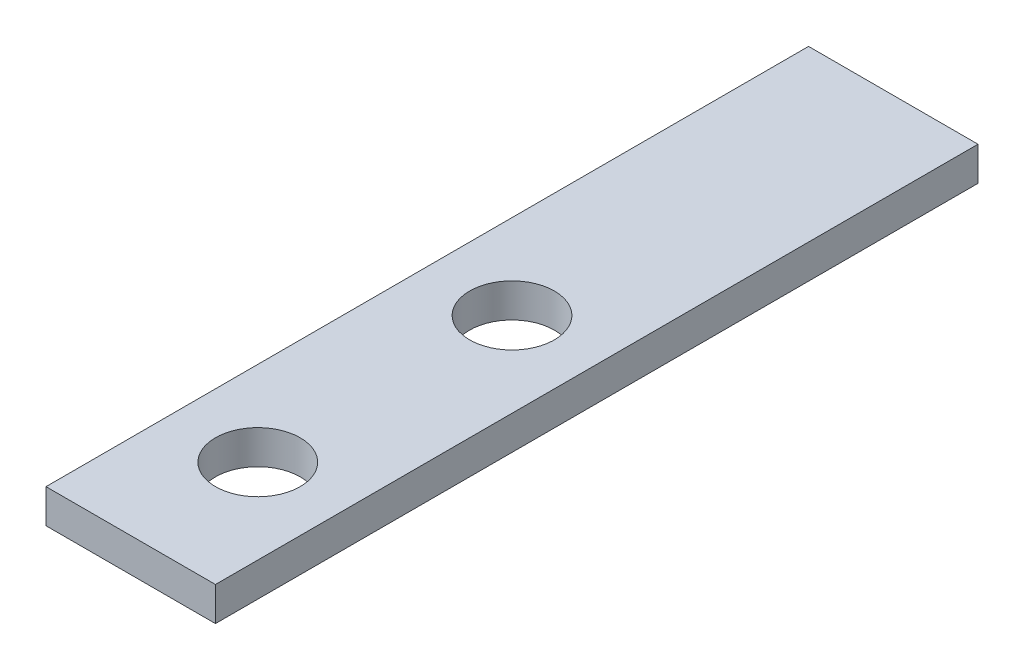
ISO-10303-21;
HEADER;
FILE_DESCRIPTION(('STEP AP214'),'2;1');
FILE_NAME('part.step','',(''),(''),'','','');
FILE_SCHEMA(('AUTOMOTIVE_DESIGN { 1 0 10303 214 1 1 1 1 }'));
ENDSEC;
DATA;
#1=APPLICATION_CONTEXT('core data for automotive mechanical design processes');
#2=APPLICATION_PROTOCOL_DEFINITION('international standard','automotive_design',2000,#1);
#3=PRODUCT_CONTEXT('',#1,'mechanical');
#4=PRODUCT('Part','Part','',(#3));
#5=PRODUCT_RELATED_PRODUCT_CATEGORY('part','',(#4));
#6=PRODUCT_DEFINITION_FORMATION('','',#4);
#7=PRODUCT_DEFINITION_CONTEXT('part definition',#1,'design');
#8=PRODUCT_DEFINITION('design','',#6,#7);
#9=PRODUCT_DEFINITION_SHAPE('','',#8);
#10=(LENGTH_UNIT() NAMED_UNIT(*) SI_UNIT(.MILLI.,.METRE.));
#11=(NAMED_UNIT(*) PLANE_ANGLE_UNIT() SI_UNIT($,.RADIAN.));
#12=(NAMED_UNIT(*) SI_UNIT($,.STERADIAN.) SOLID_ANGLE_UNIT());
#13=UNCERTAINTY_MEASURE_WITH_UNIT(LENGTH_MEASURE(1.E-05),#10,'distance_accuracy_value','');
#14=(GEOMETRIC_REPRESENTATION_CONTEXT(3) GLOBAL_UNCERTAINTY_ASSIGNED_CONTEXT((#13)) GLOBAL_UNIT_ASSIGNED_CONTEXT((#10,
#11,#12)) REPRESENTATION_CONTEXT('',''));
#15=CARTESIAN_POINT('',(0.,0.,0.));
#16=DIRECTION('',(0.,0.,1.));
#17=DIRECTION('',(1.,0.,0.));
#18=AXIS2_PLACEMENT_3D('',#15,#16,#17);
#19=CARTESIAN_POINT('',(0.,4.,0.));
#20=DIRECTION('',(0.,-1.,0.));
#21=DIRECTION('',(0.,0.,1.));
#22=AXIS2_PLACEMENT_3D('',#19,#20,#21);
#23=PLANE('',#22);
#24=DIRECTION('',(0.,0.,-1.));
#25=VECTOR('',#24,1.);
#26=CARTESIAN_POINT('',(0.,4.,0.));
#27=LINE('',#26,#25);
#28=CARTESIAN_POINT('',(0.,4.,90.));
#29=VERTEX_POINT('',#28);
#30=CARTESIAN_POINT('',(0.,4.,0.));
#31=VERTEX_POINT('',#30);
#32=EDGE_CURVE('E93',#29,#31,#27,.T.);
#33=ORIENTED_EDGE('',*,*,#32,.F.);
#34=DIRECTION('',(-1.,0.,0.));
#35=VECTOR('',#34,1.);
#36=CARTESIAN_POINT('',(0.,4.,90.));
#37=LINE('',#36,#35);
#38=CARTESIAN_POINT('',(20.,4.,90.));
#39=VERTEX_POINT('',#38);
#40=EDGE_CURVE('E96',#39,#29,#37,.T.);
#41=ORIENTED_EDGE('',*,*,#40,.F.);
#42=DIRECTION('',(0.,0.,1.));
#43=VECTOR('',#42,1.);
#44=CARTESIAN_POINT('',(20.,4.,0.));
#45=LINE('',#44,#43);
#46=CARTESIAN_POINT('',(20.,4.,0.));
#47=VERTEX_POINT('',#46);
#48=EDGE_CURVE('E84',#47,#39,#45,.T.);
#49=ORIENTED_EDGE('',*,*,#48,.F.);
#50=DIRECTION('',(1.,0.,0.));
#51=VECTOR('',#50,1.);
#52=CARTESIAN_POINT('',(0.,4.,0.));
#53=LINE('',#52,#51);
#54=EDGE_CURVE('E89',#31,#47,#53,.T.);
#55=ORIENTED_EDGE('',*,*,#54,.F.);
#56=EDGE_LOOP('',(#33,#41,#49,#55));
#57=FACE_BOUND('',#56,.T.);
#58=CARTESIAN_POINT('',(10.,4.,45.));
#59=DIRECTION('',(0.,-1.,0.));
#60=DIRECTION('',(0.,0.,-1.));
#61=AXIS2_PLACEMENT_3D('',#58,#59,#60);
#62=CIRCLE('',#61,5.00000000000001);
#63=CARTESIAN_POINT('',(10.,4.,40.));
#64=VERTEX_POINT('',#63);
#65=EDGE_CURVE('E105',#64,#64,#62,.T.);
#66=ORIENTED_EDGE('',*,*,#65,.T.);
#67=EDGE_LOOP('',(#66));
#68=FACE_BOUND('',#67,.T.);
#69=CARTESIAN_POINT('',(9.9999999999999,4.,75.));
#70=DIRECTION('',(0.,-1.,0.));
#71=DIRECTION('',(0.,0.,-1.));
#72=AXIS2_PLACEMENT_3D('',#69,#70,#71);
#73=CIRCLE('',#72,5.00000000000001);
#74=CARTESIAN_POINT('',(9.9999999999999,4.,70.));
#75=VERTEX_POINT('',#74);
#76=EDGE_CURVE('E116',#75,#75,#73,.T.);
#77=ORIENTED_EDGE('',*,*,#76,.T.);
#78=EDGE_LOOP('',(#77));
#79=FACE_BOUND('',#78,.T.);
#80=ADVANCED_FACE('F37',(#57,#68,#79),#23,.F.);
#81=CARTESIAN_POINT('',(0.,0.,0.));
#82=DIRECTION('',(0.,-1.,0.));
#83=DIRECTION('',(0.,0.,1.));
#84=AXIS2_PLACEMENT_3D('',#81,#82,#83);
#85=PLANE('',#84);
#86=CARTESIAN_POINT('',(10.,0.,45.));
#87=DIRECTION('',(0.,-1.,0.));
#88=DIRECTION('',(0.,0.,-1.));
#89=AXIS2_PLACEMENT_3D('',#86,#87,#88);
#90=CIRCLE('',#89,5.00000000000001);
#91=CARTESIAN_POINT('',(10.,0.,40.));
#92=VERTEX_POINT('',#91);
#93=EDGE_CURVE('E113',#92,#92,#90,.T.);
#94=ORIENTED_EDGE('',*,*,#93,.F.);
#95=EDGE_LOOP('',(#94));
#96=FACE_BOUND('',#95,.T.);
#97=DIRECTION('',(0.,0.,-1.));
#98=VECTOR('',#97,1.);
#99=CARTESIAN_POINT('',(0.,0.,0.));
#100=LINE('',#99,#98);
#101=CARTESIAN_POINT('',(0.,0.,90.));
#102=VERTEX_POINT('',#101);
#103=CARTESIAN_POINT('',(0.,0.,0.));
#104=VERTEX_POINT('',#103);
#105=EDGE_CURVE('E101',#102,#104,#100,.T.);
#106=ORIENTED_EDGE('',*,*,#105,.T.);
#107=DIRECTION('',(1.,0.,0.));
#108=VECTOR('',#107,1.);
#109=CARTESIAN_POINT('',(0.,0.,0.));
#110=LINE('',#109,#108);
#111=CARTESIAN_POINT('',(20.,0.,0.));
#112=VERTEX_POINT('',#111);
#113=EDGE_CURVE('E104',#104,#112,#110,.T.);
#114=ORIENTED_EDGE('',*,*,#113,.T.);
#115=DIRECTION('',(0.,0.,1.));
#116=VECTOR('',#115,1.);
#117=CARTESIAN_POINT('',(20.,0.,0.));
#118=LINE('',#117,#116);
#119=CARTESIAN_POINT('',(20.,0.,90.));
#120=VERTEX_POINT('',#119);
#121=EDGE_CURVE('E87',#112,#120,#118,.T.);
#122=ORIENTED_EDGE('',*,*,#121,.T.);
#123=DIRECTION('',(-1.,0.,0.));
#124=VECTOR('',#123,1.);
#125=CARTESIAN_POINT('',(0.,0.,90.));
#126=LINE('',#125,#124);
#127=EDGE_CURVE('E108',#120,#102,#126,.T.);
#128=ORIENTED_EDGE('',*,*,#127,.T.);
#129=EDGE_LOOP('',(#106,#114,#122,#128));
#130=FACE_BOUND('',#129,.T.);
#131=CARTESIAN_POINT('',(9.9999999999999,0.,75.));
#132=DIRECTION('',(0.,-1.,0.));
#133=DIRECTION('',(0.,0.,-1.));
#134=AXIS2_PLACEMENT_3D('',#131,#132,#133);
#135=CIRCLE('',#134,5.00000000000001);
#136=CARTESIAN_POINT('',(9.9999999999999,0.,70.));
#137=VERTEX_POINT('',#136);
#138=EDGE_CURVE('E119',#137,#137,#135,.T.);
#139=ORIENTED_EDGE('',*,*,#138,.F.);
#140=EDGE_LOOP('',(#139));
#141=FACE_BOUND('',#140,.T.);
#142=ADVANCED_FACE('F133',(#96,#130,#141),#85,.T.);
#143=CARTESIAN_POINT('',(0.,4.,0.));
#144=DIRECTION('',(1.,0.,0.));
#145=DIRECTION('',(0.,0.,1.));
#146=AXIS2_PLACEMENT_3D('',#143,#144,#145);
#147=PLANE('',#146);
#148=ORIENTED_EDGE('',*,*,#105,.F.);
#149=DIRECTION('',(0.,-1.,0.));
#150=VECTOR('',#149,1.);
#151=CARTESIAN_POINT('',(0.,4.,90.));
#152=LINE('',#151,#150);
#153=EDGE_CURVE('E54',#29,#102,#152,.T.);
#154=ORIENTED_EDGE('',*,*,#153,.F.);
#155=ORIENTED_EDGE('',*,*,#32,.T.);
#156=DIRECTION('',(0.,-1.,0.));
#157=VECTOR('',#156,1.);
#158=CARTESIAN_POINT('',(0.,4.,0.));
#159=LINE('',#158,#157);
#160=EDGE_CURVE('E11',#31,#104,#159,.T.);
#161=ORIENTED_EDGE('',*,*,#160,.T.);
#162=EDGE_LOOP('',(#148,#154,#155,#161));
#163=FACE_BOUND('',#162,.T.);
#164=ADVANCED_FACE('F39',(#163),#147,.F.);
#165=CARTESIAN_POINT('',(0.,4.,0.));
#166=DIRECTION('',(0.,0.,1.));
#167=DIRECTION('',(-1.,0.,0.));
#168=AXIS2_PLACEMENT_3D('',#165,#166,#167);
#169=PLANE('',#168);
#170=ORIENTED_EDGE('',*,*,#113,.F.);
#171=ORIENTED_EDGE('',*,*,#160,.F.);
#172=ORIENTED_EDGE('',*,*,#54,.T.);
#173=DIRECTION('',(0.,-1.,0.));
#174=VECTOR('',#173,1.);
#175=CARTESIAN_POINT('',(20.,4.,0.));
#176=LINE('',#175,#174);
#177=EDGE_CURVE('E46',#47,#112,#176,.T.);
#178=ORIENTED_EDGE('',*,*,#177,.T.);
#179=EDGE_LOOP('',(#170,#171,#172,#178));
#180=FACE_BOUND('',#179,.T.);
#181=ADVANCED_FACE('F90',(#180),#169,.F.);
#182=CARTESIAN_POINT('',(20.,4.,0.));
#183=DIRECTION('',(-1.,0.,0.));
#184=DIRECTION('',(0.,0.,-1.));
#185=AXIS2_PLACEMENT_3D('',#182,#183,#184);
#186=PLANE('',#185);
#187=ORIENTED_EDGE('',*,*,#121,.F.);
#188=ORIENTED_EDGE('',*,*,#177,.F.);
#189=ORIENTED_EDGE('',*,*,#48,.T.);
#190=DIRECTION('',(0.,-1.,0.));
#191=VECTOR('',#190,1.);
#192=CARTESIAN_POINT('',(20.,4.,90.));
#193=LINE('',#192,#191);
#194=EDGE_CURVE('E70',#39,#120,#193,.T.);
#195=ORIENTED_EDGE('',*,*,#194,.T.);
#196=EDGE_LOOP('',(#187,#188,#189,#195));
#197=FACE_BOUND('',#196,.T.);
#198=ADVANCED_FACE('F82',(#197),#186,.F.);
#199=CARTESIAN_POINT('',(0.,4.,90.));
#200=DIRECTION('',(0.,0.,-1.));
#201=DIRECTION('',(1.,0.,0.));
#202=AXIS2_PLACEMENT_3D('',#199,#200,#201);
#203=PLANE('',#202);
#204=ORIENTED_EDGE('',*,*,#127,.F.);
#205=ORIENTED_EDGE('',*,*,#194,.F.);
#206=ORIENTED_EDGE('',*,*,#40,.T.);
#207=ORIENTED_EDGE('',*,*,#153,.T.);
#208=EDGE_LOOP('',(#204,#205,#206,#207));
#209=FACE_BOUND('',#208,.T.);
#210=ADVANCED_FACE('F145',(#209),#203,.F.);
#211=CARTESIAN_POINT('',(10.,4.,45.));
#212=DIRECTION('',(0.,-1.,0.));
#213=DIRECTION('',(0.,0.,1.));
#214=AXIS2_PLACEMENT_3D('',#211,#212,#213);
#215=CYLINDRICAL_SURFACE('',#214,5.00000000000001);
#216=ORIENTED_EDGE('',*,*,#65,.F.);
#217=EDGE_LOOP('',(#216));
#218=FACE_BOUND('',#217,.T.);
#219=ORIENTED_EDGE('',*,*,#93,.T.);
#220=EDGE_LOOP('',(#219));
#221=FACE_BOUND('',#220,.T.);
#222=ADVANCED_FACE('F129',(#218,#221),#215,.F.);
#223=CARTESIAN_POINT('',(9.9999999999999,4.,75.));
#224=DIRECTION('',(0.,-1.,0.));
#225=DIRECTION('',(0.,0.,1.));
#226=AXIS2_PLACEMENT_3D('',#223,#224,#225);
#227=CYLINDRICAL_SURFACE('',#226,5.00000000000001);
#228=ORIENTED_EDGE('',*,*,#76,.F.);
#229=EDGE_LOOP('',(#228));
#230=FACE_BOUND('',#229,.T.);
#231=ORIENTED_EDGE('',*,*,#138,.T.);
#232=EDGE_LOOP('',(#231));
#233=FACE_BOUND('',#232,.T.);
#234=ADVANCED_FACE('F126',(#230,#233),#227,.F.);
#235=CLOSED_SHELL('',(#80,#142,#164,#181,#198,#210,#222,#234));
#236=MANIFOLD_SOLID_BREP('B2',#235);
#237=ADVANCED_BREP_SHAPE_REPRESENTATION('',(#18,#236),#14);
#238=SHAPE_DEFINITION_REPRESENTATION(#9,#237);
ENDSEC;
END-ISO-10303-21;
